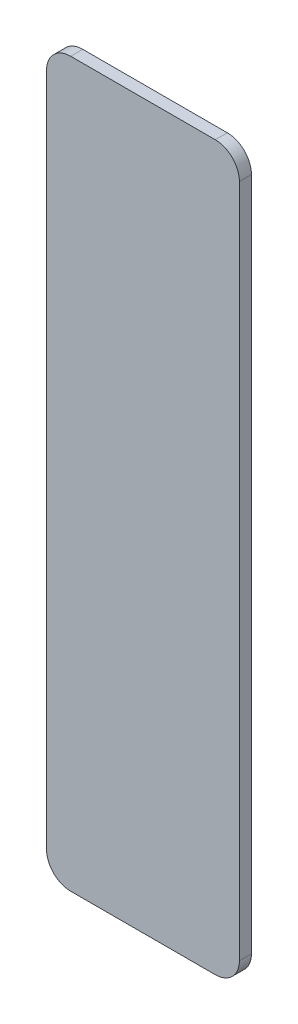
ISO-10303-21;
HEADER;
FILE_DESCRIPTION(('STEP AP214'),'2;1');
FILE_NAME('part.step','',(''),(''),'','','');
FILE_SCHEMA(('AUTOMOTIVE_DESIGN { 1 0 10303 214 1 1 1 1 }'));
ENDSEC;
DATA;
#1=APPLICATION_CONTEXT('core data for automotive mechanical design processes');
#2=APPLICATION_PROTOCOL_DEFINITION('international standard','automotive_design',2000,#1);
#3=PRODUCT_CONTEXT('',#1,'mechanical');
#4=PRODUCT('Part','Part','',(#3));
#5=PRODUCT_RELATED_PRODUCT_CATEGORY('part','',(#4));
#6=PRODUCT_DEFINITION_FORMATION('','',#4);
#7=PRODUCT_DEFINITION_CONTEXT('part definition',#1,'design');
#8=PRODUCT_DEFINITION('design','',#6,#7);
#9=PRODUCT_DEFINITION_SHAPE('','',#8);
#10=(LENGTH_UNIT() NAMED_UNIT(*) SI_UNIT(.MILLI.,.METRE.));
#11=(NAMED_UNIT(*) PLANE_ANGLE_UNIT() SI_UNIT($,.RADIAN.));
#12=(NAMED_UNIT(*) SI_UNIT($,.STERADIAN.) SOLID_ANGLE_UNIT());
#13=UNCERTAINTY_MEASURE_WITH_UNIT(LENGTH_MEASURE(1.E-05),#10,'distance_accuracy_value','');
#14=(GEOMETRIC_REPRESENTATION_CONTEXT(3) GLOBAL_UNCERTAINTY_ASSIGNED_CONTEXT((#13)) GLOBAL_UNIT_ASSIGNED_CONTEXT((#10,
#11,#12)) REPRESENTATION_CONTEXT('',''));
#15=CARTESIAN_POINT('',(0.,0.,0.));
#16=DIRECTION('',(0.,0.,1.));
#17=DIRECTION('',(1.,0.,0.));
#18=AXIS2_PLACEMENT_3D('',#15,#16,#17);
#19=CARTESIAN_POINT('',(4.,-15.,0.5));
#20=DIRECTION('',(-1.,0.,0.));
#21=DIRECTION('',(0.,0.,1.));
#22=AXIS2_PLACEMENT_3D('',#19,#20,#21);
#23=PLANE('',#22);
#24=DIRECTION('',(0.,1.,0.));
#25=VECTOR('',#24,1.);
#26=CARTESIAN_POINT('',(4.,-15.,0.5));
#27=LINE('',#26,#25);
#28=CARTESIAN_POINT('',(4.,-14.,0.5));
#29=VERTEX_POINT('',#28);
#30=CARTESIAN_POINT('',(4.,14.,0.5));
#31=VERTEX_POINT('',#30);
#32=EDGE_CURVE('E124',#29,#31,#27,.T.);
#33=ORIENTED_EDGE('',*,*,#32,.F.);
#34=DIRECTION('',(0.,0.,-1.));
#35=VECTOR('',#34,1.);
#36=CARTESIAN_POINT('',(4.,-14.,0.5));
#37=LINE('',#36,#35);
#38=CARTESIAN_POINT('',(4.,-14.,0.));
#39=VERTEX_POINT('',#38);
#40=EDGE_CURVE('E150',#29,#39,#37,.T.);
#41=ORIENTED_EDGE('',*,*,#40,.T.);
#42=DIRECTION('',(0.,1.,0.));
#43=VECTOR('',#42,1.);
#44=CARTESIAN_POINT('',(4.,-15.,0.));
#45=LINE('',#44,#43);
#46=CARTESIAN_POINT('',(4.,14.,0.));
#47=VERTEX_POINT('',#46);
#48=EDGE_CURVE('E156',#39,#47,#45,.T.);
#49=ORIENTED_EDGE('',*,*,#48,.T.);
#50=DIRECTION('',(0.,0.,-1.));
#51=VECTOR('',#50,1.);
#52=CARTESIAN_POINT('',(4.,14.,0.5));
#53=LINE('',#52,#51);
#54=EDGE_CURVE('E148',#47,#31,#53,.F.);
#55=ORIENTED_EDGE('',*,*,#54,.T.);
#56=EDGE_LOOP('',(#33,#41,#49,#55));
#57=FACE_BOUND('',#56,.T.);
#58=ADVANCED_FACE('F32',(#57),#23,.F.);
#59=CARTESIAN_POINT('',(-4.,15.,0.5));
#60=DIRECTION('',(0.,-1.,0.));
#61=DIRECTION('',(0.,0.,-1.));
#62=AXIS2_PLACEMENT_3D('',#59,#60,#61);
#63=PLANE('',#62);
#64=DIRECTION('',(-1.,0.,0.));
#65=VECTOR('',#64,1.);
#66=CARTESIAN_POINT('',(-4.,15.,0.5));
#67=LINE('',#66,#65);
#68=CARTESIAN_POINT('',(3.,15.,0.5));
#69=VERTEX_POINT('',#68);
#70=CARTESIAN_POINT('',(-3.,15.,0.5));
#71=VERTEX_POINT('',#70);
#72=EDGE_CURVE('E127',#69,#71,#67,.T.);
#73=ORIENTED_EDGE('',*,*,#72,.F.);
#74=DIRECTION('',(0.,0.,-1.));
#75=VECTOR('',#74,1.);
#76=CARTESIAN_POINT('',(3.,15.,0.5));
#77=LINE('',#76,#75);
#78=CARTESIAN_POINT('',(3.,15.,0.));
#79=VERTEX_POINT('',#78);
#80=EDGE_CURVE('E11',#69,#79,#77,.T.);
#81=ORIENTED_EDGE('',*,*,#80,.T.);
#82=DIRECTION('',(-1.,0.,0.));
#83=VECTOR('',#82,1.);
#84=CARTESIAN_POINT('',(-4.,15.,0.));
#85=LINE('',#84,#83);
#86=CARTESIAN_POINT('',(-3.,15.,0.));
#87=VERTEX_POINT('',#86);
#88=EDGE_CURVE('E129',#79,#87,#85,.T.);
#89=ORIENTED_EDGE('',*,*,#88,.T.);
#90=DIRECTION('',(0.,0.,-1.));
#91=VECTOR('',#90,1.);
#92=CARTESIAN_POINT('',(-3.,15.,0.5));
#93=LINE('',#92,#91);
#94=EDGE_CURVE('E40',#87,#71,#93,.F.);
#95=ORIENTED_EDGE('',*,*,#94,.T.);
#96=EDGE_LOOP('',(#73,#81,#89,#95));
#97=FACE_BOUND('',#96,.T.);
#98=ADVANCED_FACE('F175',(#97),#63,.F.);
#99=CARTESIAN_POINT('',(-4.,-15.,0.5));
#100=DIRECTION('',(1.,0.,0.));
#101=DIRECTION('',(0.,0.,-1.));
#102=AXIS2_PLACEMENT_3D('',#99,#100,#101);
#103=PLANE('',#102);
#104=DIRECTION('',(0.,-1.,0.));
#105=VECTOR('',#104,1.);
#106=CARTESIAN_POINT('',(-4.,-15.,0.));
#107=LINE('',#106,#105);
#108=CARTESIAN_POINT('',(-4.,14.,0.));
#109=VERTEX_POINT('',#108);
#110=CARTESIAN_POINT('',(-4.,-14.,0.));
#111=VERTEX_POINT('',#110);
#112=EDGE_CURVE('E125',#109,#111,#107,.T.);
#113=ORIENTED_EDGE('',*,*,#112,.T.);
#114=DIRECTION('',(0.,0.,-1.));
#115=VECTOR('',#114,1.);
#116=CARTESIAN_POINT('',(-4.,-14.,0.5));
#117=LINE('',#116,#115);
#118=CARTESIAN_POINT('',(-4.,-14.,0.5));
#119=VERTEX_POINT('',#118);
#120=EDGE_CURVE('E103',#111,#119,#117,.F.);
#121=ORIENTED_EDGE('',*,*,#120,.T.);
#122=DIRECTION('',(0.,-1.,0.));
#123=VECTOR('',#122,1.);
#124=CARTESIAN_POINT('',(-4.,-15.,0.5));
#125=LINE('',#124,#123);
#126=CARTESIAN_POINT('',(-4.,14.,0.5));
#127=VERTEX_POINT('',#126);
#128=EDGE_CURVE('E164',#127,#119,#125,.T.);
#129=ORIENTED_EDGE('',*,*,#128,.F.);
#130=DIRECTION('',(0.,0.,-1.));
#131=VECTOR('',#130,1.);
#132=CARTESIAN_POINT('',(-4.,14.,0.5));
#133=LINE('',#132,#131);
#134=EDGE_CURVE('E108',#127,#109,#133,.T.);
#135=ORIENTED_EDGE('',*,*,#134,.T.);
#136=EDGE_LOOP('',(#113,#121,#129,#135));
#137=FACE_BOUND('',#136,.T.);
#138=ADVANCED_FACE('F174',(#137),#103,.F.);
#139=CARTESIAN_POINT('',(-4.,-15.,0.5));
#140=DIRECTION('',(0.,1.,0.));
#141=DIRECTION('',(0.,0.,1.));
#142=AXIS2_PLACEMENT_3D('',#139,#140,#141);
#143=PLANE('',#142);
#144=DIRECTION('',(1.,0.,0.));
#145=VECTOR('',#144,1.);
#146=CARTESIAN_POINT('',(-4.,-15.,0.5));
#147=LINE('',#146,#145);
#148=CARTESIAN_POINT('',(-3.,-15.,0.5));
#149=VERTEX_POINT('',#148);
#150=CARTESIAN_POINT('',(3.,-15.,0.5));
#151=VERTEX_POINT('',#150);
#152=EDGE_CURVE('E118',#149,#151,#147,.T.);
#153=ORIENTED_EDGE('',*,*,#152,.F.);
#154=DIRECTION('',(0.,0.,-1.));
#155=VECTOR('',#154,1.);
#156=CARTESIAN_POINT('',(-3.,-15.,0.5));
#157=LINE('',#156,#155);
#158=CARTESIAN_POINT('',(-3.,-15.,0.));
#159=VERTEX_POINT('',#158);
#160=EDGE_CURVE('E102',#149,#159,#157,.T.);
#161=ORIENTED_EDGE('',*,*,#160,.T.);
#162=DIRECTION('',(1.,0.,0.));
#163=VECTOR('',#162,1.);
#164=CARTESIAN_POINT('',(-4.,-15.,0.));
#165=LINE('',#164,#163);
#166=CARTESIAN_POINT('',(3.,-15.,0.));
#167=VERTEX_POINT('',#166);
#168=EDGE_CURVE('E115',#159,#167,#165,.T.);
#169=ORIENTED_EDGE('',*,*,#168,.T.);
#170=DIRECTION('',(0.,0.,-1.));
#171=VECTOR('',#170,1.);
#172=CARTESIAN_POINT('',(3.,-15.,0.5));
#173=LINE('',#172,#171);
#174=EDGE_CURVE('E120',#167,#151,#173,.F.);
#175=ORIENTED_EDGE('',*,*,#174,.T.);
#176=EDGE_LOOP('',(#153,#161,#169,#175));
#177=FACE_BOUND('',#176,.T.);
#178=ADVANCED_FACE('F114',(#177),#143,.F.);
#179=CARTESIAN_POINT('',(0.,0.,0.5));
#180=DIRECTION('',(0.,0.,-1.));
#181=DIRECTION('',(-1.,0.,0.));
#182=AXIS2_PLACEMENT_3D('',#179,#180,#181);
#183=PLANE('',#182);
#184=ORIENTED_EDGE('',*,*,#128,.T.);
#185=CARTESIAN_POINT('',(-3.,-14.,0.5));
#186=DIRECTION('',(0.,0.,-1.));
#187=DIRECTION('',(-1.,0.,0.));
#188=AXIS2_PLACEMENT_3D('',#185,#186,#187);
#189=CIRCLE('',#188,1.);
#190=EDGE_CURVE('E146',#119,#149,#189,.F.);
#191=ORIENTED_EDGE('',*,*,#190,.T.);
#192=ORIENTED_EDGE('',*,*,#152,.T.);
#193=CARTESIAN_POINT('',(3.,-14.,0.5));
#194=DIRECTION('',(0.,0.,-1.));
#195=DIRECTION('',(-1.,0.,0.));
#196=AXIS2_PLACEMENT_3D('',#193,#194,#195);
#197=CIRCLE('',#196,1.);
#198=EDGE_CURVE('E144',#151,#29,#197,.F.);
#199=ORIENTED_EDGE('',*,*,#198,.T.);
#200=ORIENTED_EDGE('',*,*,#32,.T.);
#201=CARTESIAN_POINT('',(3.,14.,0.5));
#202=DIRECTION('',(0.,0.,-1.));
#203=DIRECTION('',(-1.,0.,0.));
#204=AXIS2_PLACEMENT_3D('',#201,#202,#203);
#205=CIRCLE('',#204,1.);
#206=EDGE_CURVE('E53',#31,#69,#205,.F.);
#207=ORIENTED_EDGE('',*,*,#206,.T.);
#208=ORIENTED_EDGE('',*,*,#72,.T.);
#209=CARTESIAN_POINT('',(-3.,14.,0.5));
#210=DIRECTION('',(0.,0.,-1.));
#211=DIRECTION('',(-1.,0.,0.));
#212=AXIS2_PLACEMENT_3D('',#209,#210,#211);
#213=CIRCLE('',#212,1.);
#214=EDGE_CURVE('E141',#71,#127,#213,.F.);
#215=ORIENTED_EDGE('',*,*,#214,.T.);
#216=EDGE_LOOP('',(#184,#191,#192,#199,#200,#207,#208,#215));
#217=FACE_BOUND('',#216,.T.);
#218=ADVANCED_FACE('F168',(#217),#183,.F.);
#219=CARTESIAN_POINT('',(0.,0.,0.));
#220=DIRECTION('',(0.,0.,-1.));
#221=DIRECTION('',(-1.,0.,0.));
#222=AXIS2_PLACEMENT_3D('',#219,#220,#221);
#223=PLANE('',#222);
#224=ORIENTED_EDGE('',*,*,#168,.F.);
#225=CARTESIAN_POINT('',(-3.,-14.,0.));
#226=DIRECTION('',(0.,0.,-1.));
#227=DIRECTION('',(-1.,0.,0.));
#228=AXIS2_PLACEMENT_3D('',#225,#226,#227);
#229=CIRCLE('',#228,1.);
#230=EDGE_CURVE('E98',#159,#111,#229,.T.);
#231=ORIENTED_EDGE('',*,*,#230,.T.);
#232=ORIENTED_EDGE('',*,*,#112,.F.);
#233=CARTESIAN_POINT('',(-3.,14.,0.));
#234=DIRECTION('',(0.,0.,-1.));
#235=DIRECTION('',(-1.,0.,0.));
#236=AXIS2_PLACEMENT_3D('',#233,#234,#235);
#237=CIRCLE('',#236,1.);
#238=EDGE_CURVE('E119',#109,#87,#237,.T.);
#239=ORIENTED_EDGE('',*,*,#238,.T.);
#240=ORIENTED_EDGE('',*,*,#88,.F.);
#241=CARTESIAN_POINT('',(3.,14.,0.));
#242=DIRECTION('',(0.,0.,-1.));
#243=DIRECTION('',(-1.,0.,0.));
#244=AXIS2_PLACEMENT_3D('',#241,#242,#243);
#245=CIRCLE('',#244,1.);
#246=EDGE_CURVE('E135',#79,#47,#245,.T.);
#247=ORIENTED_EDGE('',*,*,#246,.T.);
#248=ORIENTED_EDGE('',*,*,#48,.F.);
#249=CARTESIAN_POINT('',(3.,-14.,0.));
#250=DIRECTION('',(0.,0.,-1.));
#251=DIRECTION('',(-1.,0.,0.));
#252=AXIS2_PLACEMENT_3D('',#249,#250,#251);
#253=CIRCLE('',#252,1.);
#254=EDGE_CURVE('E109',#39,#167,#253,.T.);
#255=ORIENTED_EDGE('',*,*,#254,.T.);
#256=EDGE_LOOP('',(#224,#231,#232,#239,#240,#247,#248,#255));
#257=FACE_BOUND('',#256,.T.);
#258=ADVANCED_FACE('F122',(#257),#223,.T.);
#259=CARTESIAN_POINT('',(-3.,-14.,0.5));
#260=DIRECTION('',(0.,0.,-1.));
#261=DIRECTION('',(-1.,0.,0.));
#262=AXIS2_PLACEMENT_3D('',#259,#260,#261);
#263=CYLINDRICAL_SURFACE('',#262,1.);
#264=ORIENTED_EDGE('',*,*,#190,.F.);
#265=ORIENTED_EDGE('',*,*,#120,.F.);
#266=ORIENTED_EDGE('',*,*,#230,.F.);
#267=ORIENTED_EDGE('',*,*,#160,.F.);
#268=EDGE_LOOP('',(#264,#265,#266,#267));
#269=FACE_BOUND('',#268,.T.);
#270=ADVANCED_FACE('F101',(#269),#263,.T.);
#271=CARTESIAN_POINT('',(3.,-14.,0.5));
#272=DIRECTION('',(0.,0.,-1.));
#273=DIRECTION('',(-1.,0.,0.));
#274=AXIS2_PLACEMENT_3D('',#271,#272,#273);
#275=CYLINDRICAL_SURFACE('',#274,1.);
#276=ORIENTED_EDGE('',*,*,#198,.F.);
#277=ORIENTED_EDGE('',*,*,#174,.F.);
#278=ORIENTED_EDGE('',*,*,#254,.F.);
#279=ORIENTED_EDGE('',*,*,#40,.F.);
#280=EDGE_LOOP('',(#276,#277,#278,#279));
#281=FACE_BOUND('',#280,.T.);
#282=ADVANCED_FACE('F178',(#281),#275,.T.);
#283=CARTESIAN_POINT('',(3.,14.,0.5));
#284=DIRECTION('',(0.,0.,-1.));
#285=DIRECTION('',(-1.,0.,0.));
#286=AXIS2_PLACEMENT_3D('',#283,#284,#285);
#287=CYLINDRICAL_SURFACE('',#286,1.);
#288=ORIENTED_EDGE('',*,*,#206,.F.);
#289=ORIENTED_EDGE('',*,*,#54,.F.);
#290=ORIENTED_EDGE('',*,*,#246,.F.);
#291=ORIENTED_EDGE('',*,*,#80,.F.);
#292=EDGE_LOOP('',(#288,#289,#290,#291));
#293=FACE_BOUND('',#292,.T.);
#294=ADVANCED_FACE('F177',(#293),#287,.T.);
#295=CARTESIAN_POINT('',(-3.,14.,0.5));
#296=DIRECTION('',(0.,0.,-1.));
#297=DIRECTION('',(-1.,0.,0.));
#298=AXIS2_PLACEMENT_3D('',#295,#296,#297);
#299=CYLINDRICAL_SURFACE('',#298,1.);
#300=ORIENTED_EDGE('',*,*,#214,.F.);
#301=ORIENTED_EDGE('',*,*,#94,.F.);
#302=ORIENTED_EDGE('',*,*,#238,.F.);
#303=ORIENTED_EDGE('',*,*,#134,.F.);
#304=EDGE_LOOP('',(#300,#301,#302,#303));
#305=FACE_BOUND('',#304,.T.);
#306=ADVANCED_FACE('F34',(#305),#299,.T.);
#307=CLOSED_SHELL('',(#58,#98,#138,#178,#218,#258,#270,#282,#294,#306));
#308=MANIFOLD_SOLID_BREP('B2',#307);
#309=ADVANCED_BREP_SHAPE_REPRESENTATION('',(#18,#308),#14);
#310=SHAPE_DEFINITION_REPRESENTATION(#9,#309);
ENDSEC;
END-ISO-10303-21;
